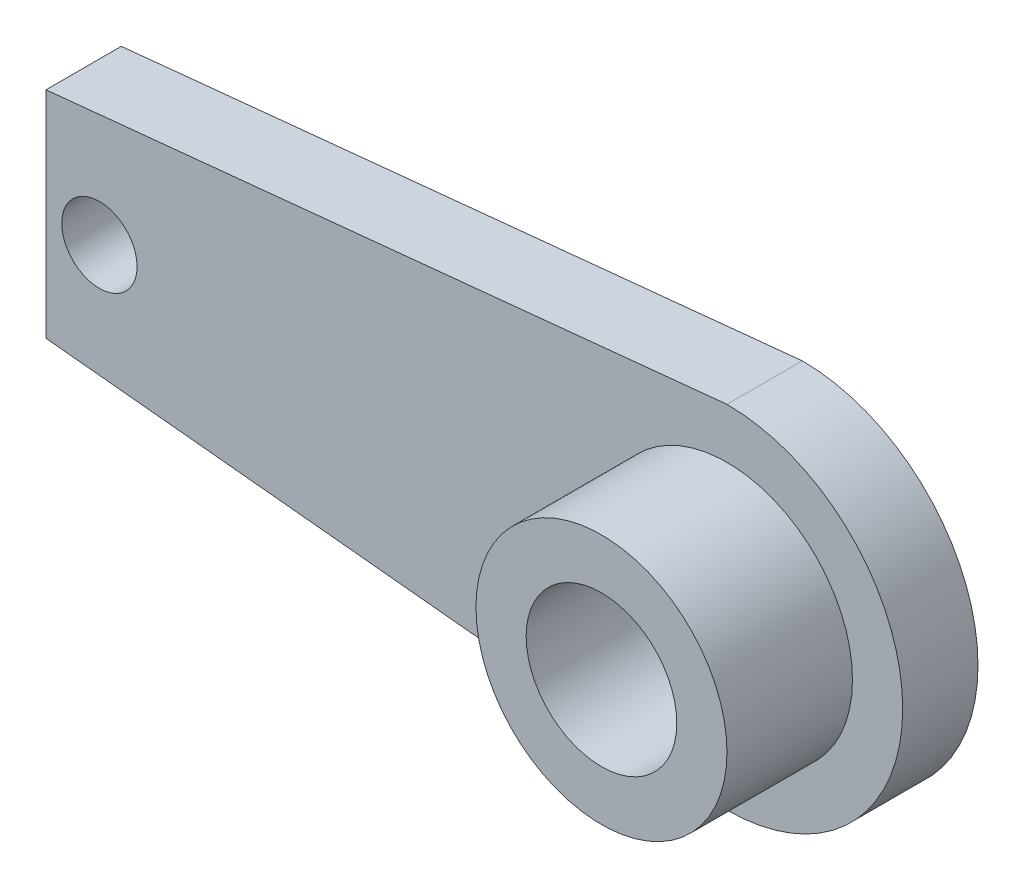
ISO-10303-21;
HEADER;
FILE_DESCRIPTION(('STEP AP214'),'2;1');
FILE_NAME('part.step','',(''),(''),'','','');
FILE_SCHEMA(('AUTOMOTIVE_DESIGN { 1 0 10303 214 1 1 1 1 }'));
ENDSEC;
DATA;
#1=APPLICATION_CONTEXT('core data for automotive mechanical design processes');
#2=APPLICATION_PROTOCOL_DEFINITION('international standard','automotive_design',2000,#1);
#3=PRODUCT_CONTEXT('',#1,'mechanical');
#4=PRODUCT('Part','Part','',(#3));
#5=PRODUCT_RELATED_PRODUCT_CATEGORY('part','',(#4));
#6=PRODUCT_DEFINITION_FORMATION('','',#4);
#7=PRODUCT_DEFINITION_CONTEXT('part definition',#1,'design');
#8=PRODUCT_DEFINITION('design','',#6,#7);
#9=PRODUCT_DEFINITION_SHAPE('','',#8);
#10=(LENGTH_UNIT() NAMED_UNIT(*) SI_UNIT(.MILLI.,.METRE.));
#11=(NAMED_UNIT(*) PLANE_ANGLE_UNIT() SI_UNIT($,.RADIAN.));
#12=(NAMED_UNIT(*) SI_UNIT($,.STERADIAN.) SOLID_ANGLE_UNIT());
#13=UNCERTAINTY_MEASURE_WITH_UNIT(LENGTH_MEASURE(1.E-05),#10,'distance_accuracy_value','');
#14=(GEOMETRIC_REPRESENTATION_CONTEXT(3) GLOBAL_UNCERTAINTY_ASSIGNED_CONTEXT((#13)) GLOBAL_UNIT_ASSIGNED_CONTEXT((#10,
#11,#12)) REPRESENTATION_CONTEXT('',''));
#15=CARTESIAN_POINT('',(0.,0.,0.));
#16=DIRECTION('',(0.,0.,1.));
#17=DIRECTION('',(1.,0.,0.));
#18=AXIS2_PLACEMENT_3D('',#15,#16,#17);
#19=CARTESIAN_POINT('',(-30.,-4.,-8.));
#20=DIRECTION('',(0.099503719020999,0.995037190209989,0.));
#21=DIRECTION('',(-0.995037190209989,0.099503719020999,0.));
#22=AXIS2_PLACEMENT_3D('',#19,#20,#21);
#23=PLANE('',#22);
#24=DIRECTION('',(0.,0.,1.));
#25=VECTOR('',#24,1.);
#26=CARTESIAN_POINT('',(-27.1280270584127,-4.28719729415873,-15.));
#27=LINE('',#26,#25);
#28=CARTESIAN_POINT('',(-27.1280270584127,-4.28719729415873,-8.));
#29=VERTEX_POINT('',#28);
#30=CARTESIAN_POINT('',(-27.1280270584127,-4.28719729415873,-5.));
#31=VERTEX_POINT('',#30);
#32=EDGE_CURVE('E146',#29,#31,#27,.T.);
#33=ORIENTED_EDGE('',*,*,#32,.F.);
#34=DIRECTION('',(0.995037190209989,-0.0995037190209989,0.));
#35=VECTOR('',#34,1.);
#36=CARTESIAN_POINT('',(-30.,-4.,-8.));
#37=LINE('',#36,#35);
#38=CARTESIAN_POINT('',(0.,-7.,-8.));
#39=VERTEX_POINT('',#38);
#40=EDGE_CURVE('E90',#29,#39,#37,.T.);
#41=ORIENTED_EDGE('',*,*,#40,.T.);
#42=DIRECTION('',(0.,0.,1.));
#43=VECTOR('',#42,1.);
#44=CARTESIAN_POINT('',(0.,-7.,-8.));
#45=LINE('',#44,#43);
#46=CARTESIAN_POINT('',(0.,-7.,-5.));
#47=VERTEX_POINT('',#46);
#48=EDGE_CURVE('E85',#39,#47,#45,.T.);
#49=ORIENTED_EDGE('',*,*,#48,.T.);
#50=DIRECTION('',(0.995037190209989,-0.0995037190209989,0.));
#51=VECTOR('',#50,1.);
#52=CARTESIAN_POINT('',(-30.,-4.,-5.));
#53=LINE('',#52,#51);
#54=EDGE_CURVE('E77',#31,#47,#53,.T.);
#55=ORIENTED_EDGE('',*,*,#54,.F.);
#56=EDGE_LOOP('',(#33,#41,#49,#55));
#57=FACE_BOUND('',#56,.T.);
#58=ADVANCED_FACE('F35',(#57),#23,.F.);
#59=CARTESIAN_POINT('',(-30.,4.,-8.));
#60=DIRECTION('',(0.099503719020999,-0.995037190209989,0.));
#61=DIRECTION('',(0.995037190209989,0.099503719020999,0.));
#62=AXIS2_PLACEMENT_3D('',#59,#60,#61);
#63=PLANE('',#62);
#64=DIRECTION('',(0.,0.,1.));
#65=VECTOR('',#64,1.);
#66=CARTESIAN_POINT('',(-27.1280270584127,4.28719729415873,-15.));
#67=LINE('',#66,#65);
#68=CARTESIAN_POINT('',(-27.1280270584127,4.28719729415873,-8.));
#69=VERTEX_POINT('',#68);
#70=CARTESIAN_POINT('',(-27.1280270584127,4.28719729415873,-5.));
#71=VERTEX_POINT('',#70);
#72=EDGE_CURVE('E89',#69,#71,#67,.T.);
#73=ORIENTED_EDGE('',*,*,#72,.T.);
#74=DIRECTION('',(-0.995037190209989,-0.0995037190209989,0.));
#75=VECTOR('',#74,1.);
#76=CARTESIAN_POINT('',(-30.,4.,-5.));
#77=LINE('',#76,#75);
#78=CARTESIAN_POINT('',(0.,7.,-5.));
#79=VERTEX_POINT('',#78);
#80=EDGE_CURVE('E74',#79,#71,#77,.T.);
#81=ORIENTED_EDGE('',*,*,#80,.F.);
#82=DIRECTION('',(0.,0.,1.));
#83=VECTOR('',#82,1.);
#84=CARTESIAN_POINT('',(0.,7.,-8.));
#85=LINE('',#84,#83);
#86=CARTESIAN_POINT('',(0.,7.,-8.));
#87=VERTEX_POINT('',#86);
#88=EDGE_CURVE('E81',#87,#79,#85,.T.);
#89=ORIENTED_EDGE('',*,*,#88,.F.);
#90=DIRECTION('',(-0.995037190209989,-0.0995037190209989,0.));
#91=VECTOR('',#90,1.);
#92=CARTESIAN_POINT('',(-30.,4.,-8.));
#93=LINE('',#92,#91);
#94=EDGE_CURVE('E86',#87,#69,#93,.T.);
#95=ORIENTED_EDGE('',*,*,#94,.T.);
#96=EDGE_LOOP('',(#73,#81,#89,#95));
#97=FACE_BOUND('',#96,.T.);
#98=ADVANCED_FACE('F88',(#97),#63,.F.);
#99=CARTESIAN_POINT('',(-30.,0.,-8.));
#100=DIRECTION('',(0.,0.,-1.));
#101=DIRECTION('',(1.,0.,0.));
#102=AXIS2_PLACEMENT_3D('',#99,#100,#101);
#103=PLANE('',#102);
#104=CARTESIAN_POINT('',(0.,0.,-8.));
#105=DIRECTION('',(0.,0.,-1.));
#106=DIRECTION('',(-1.,0.,0.));
#107=AXIS2_PLACEMENT_3D('',#104,#105,#106);
#108=CIRCLE('',#107,3.);
#109=CARTESIAN_POINT('',(-3.,0.,-8.));
#110=VERTEX_POINT('',#109);
#111=EDGE_CURVE('E148',#110,#110,#108,.T.);
#112=ORIENTED_EDGE('',*,*,#111,.F.);
#113=EDGE_LOOP('',(#112));
#114=FACE_BOUND('',#113,.T.);
#115=CARTESIAN_POINT('',(-25.,0.,-8.));
#116=DIRECTION('',(0.,0.,-1.));
#117=DIRECTION('',(-1.,0.,0.));
#118=AXIS2_PLACEMENT_3D('',#115,#116,#117);
#119=CIRCLE('',#118,1.5);
#120=CARTESIAN_POINT('',(-26.5,0.,-8.));
#121=VERTEX_POINT('',#120);
#122=EDGE_CURVE('E156',#121,#121,#119,.T.);
#123=ORIENTED_EDGE('',*,*,#122,.F.);
#124=EDGE_LOOP('',(#123));
#125=FACE_BOUND('',#124,.T.);
#126=ORIENTED_EDGE('',*,*,#94,.F.);
#127=CARTESIAN_POINT('',(0.,0.,-8.));
#128=DIRECTION('',(0.,0.,1.));
#129=DIRECTION('',(1.,0.,0.));
#130=AXIS2_PLACEMENT_3D('',#127,#128,#129);
#131=CIRCLE('',#130,7.);
#132=EDGE_CURVE('E59',#39,#87,#131,.T.);
#133=ORIENTED_EDGE('',*,*,#132,.F.);
#134=ORIENTED_EDGE('',*,*,#40,.F.);
#135=DIRECTION('',(0.,-1.,0.));
#136=VECTOR('',#135,1.);
#137=CARTESIAN_POINT('',(-27.1280270584127,0.,-8.));
#138=LINE('',#137,#136);
#139=EDGE_CURVE('E144',#69,#29,#138,.T.);
#140=ORIENTED_EDGE('',*,*,#139,.F.);
#141=EDGE_LOOP('',(#126,#133,#134,#140));
#142=FACE_BOUND('',#141,.T.);
#143=ADVANCED_FACE('F121',(#114,#125,#142),#103,.T.);
#144=CARTESIAN_POINT('',(-30.,0.,-5.));
#145=DIRECTION('',(0.,0.,-1.));
#146=DIRECTION('',(1.,0.,0.));
#147=AXIS2_PLACEMENT_3D('',#144,#145,#146);
#148=PLANE('',#147);
#149=CARTESIAN_POINT('',(0.,0.,-5.));
#150=DIRECTION('',(0.,0.,1.));
#151=DIRECTION('',(1.,0.,0.));
#152=AXIS2_PLACEMENT_3D('',#149,#150,#151);
#153=CIRCLE('',#152,5.);
#154=CARTESIAN_POINT('',(5.,0.,-5.));
#155=VERTEX_POINT('',#154);
#156=EDGE_CURVE('E11',#155,#155,#153,.T.);
#157=ORIENTED_EDGE('',*,*,#156,.F.);
#158=EDGE_LOOP('',(#157));
#159=FACE_BOUND('',#158,.T.);
#160=CARTESIAN_POINT('',(-25.,0.,-5.));
#161=DIRECTION('',(0.,0.,-1.));
#162=DIRECTION('',(-1.,0.,0.));
#163=AXIS2_PLACEMENT_3D('',#160,#161,#162);
#164=CIRCLE('',#163,1.5);
#165=CARTESIAN_POINT('',(-26.5,0.,-5.));
#166=VERTEX_POINT('',#165);
#167=EDGE_CURVE('E155',#166,#166,#164,.T.);
#168=ORIENTED_EDGE('',*,*,#167,.T.);
#169=EDGE_LOOP('',(#168));
#170=FACE_BOUND('',#169,.T.);
#171=DIRECTION('',(0.,1.,0.));
#172=VECTOR('',#171,1.);
#173=CARTESIAN_POINT('',(-27.1280270584127,0.,-5.));
#174=LINE('',#173,#172);
#175=EDGE_CURVE('E50',#31,#71,#174,.T.);
#176=ORIENTED_EDGE('',*,*,#175,.F.);
#177=ORIENTED_EDGE('',*,*,#54,.T.);
#178=CARTESIAN_POINT('',(0.,0.,-5.));
#179=DIRECTION('',(0.,0.,1.));
#180=DIRECTION('',(1.,0.,0.));
#181=AXIS2_PLACEMENT_3D('',#178,#179,#180);
#182=CIRCLE('',#181,7.);
#183=EDGE_CURVE('E71',#47,#79,#182,.T.);
#184=ORIENTED_EDGE('',*,*,#183,.T.);
#185=ORIENTED_EDGE('',*,*,#80,.T.);
#186=EDGE_LOOP('',(#176,#177,#184,#185));
#187=FACE_BOUND('',#186,.T.);
#188=ADVANCED_FACE('F72',(#159,#170,#187),#148,.F.);
#189=CARTESIAN_POINT('',(0.,0.,0.));
#190=DIRECTION('',(0.,0.,-1.));
#191=DIRECTION('',(1.,0.,0.));
#192=AXIS2_PLACEMENT_3D('',#189,#190,#191);
#193=PLANE('',#192);
#194=CARTESIAN_POINT('',(0.,0.,0.));
#195=DIRECTION('',(0.,0.,1.));
#196=DIRECTION('',(1.,0.,0.));
#197=AXIS2_PLACEMENT_3D('',#194,#195,#196);
#198=CIRCLE('',#197,5.);
#199=CARTESIAN_POINT('',(5.,0.,0.));
#200=VERTEX_POINT('',#199);
#201=EDGE_CURVE('E39',#200,#200,#198,.T.);
#202=ORIENTED_EDGE('',*,*,#201,.T.);
#203=EDGE_LOOP('',(#202));
#204=FACE_BOUND('',#203,.T.);
#205=CARTESIAN_POINT('',(0.,0.,0.));
#206=DIRECTION('',(0.,0.,1.));
#207=DIRECTION('',(1.,0.,0.));
#208=AXIS2_PLACEMENT_3D('',#205,#206,#207);
#209=CIRCLE('',#208,3.);
#210=CARTESIAN_POINT('',(3.,0.,0.));
#211=VERTEX_POINT('',#210);
#212=EDGE_CURVE('E97',#211,#211,#209,.T.);
#213=ORIENTED_EDGE('',*,*,#212,.F.);
#214=EDGE_LOOP('',(#213));
#215=FACE_BOUND('',#214,.T.);
#216=ADVANCED_FACE('F104',(#204,#215),#193,.F.);
#217=CARTESIAN_POINT('',(0.,0.,-5.));
#218=DIRECTION('',(0.,0.,1.));
#219=DIRECTION('',(-1.,0.,0.));
#220=AXIS2_PLACEMENT_3D('',#217,#218,#219);
#221=CYLINDRICAL_SURFACE('',#220,5.);
#222=ORIENTED_EDGE('',*,*,#156,.T.);
#223=EDGE_LOOP('',(#222));
#224=FACE_BOUND('',#223,.T.);
#225=ORIENTED_EDGE('',*,*,#201,.F.);
#226=EDGE_LOOP('',(#225));
#227=FACE_BOUND('',#226,.T.);
#228=ADVANCED_FACE('F37',(#224,#227),#221,.T.);
#229=CARTESIAN_POINT('',(0.,0.,-5.));
#230=DIRECTION('',(0.,0.,1.));
#231=DIRECTION('',(-1.,0.,0.));
#232=AXIS2_PLACEMENT_3D('',#229,#230,#231);
#233=CYLINDRICAL_SURFACE('',#232,3.);
#234=ORIENTED_EDGE('',*,*,#212,.T.);
#235=EDGE_LOOP('',(#234));
#236=FACE_BOUND('',#235,.T.);
#237=ORIENTED_EDGE('',*,*,#111,.T.);
#238=EDGE_LOOP('',(#237));
#239=FACE_BOUND('',#238,.T.);
#240=ADVANCED_FACE('F108',(#236,#239),#233,.F.);
#241=CARTESIAN_POINT('',(0.,0.,-8.));
#242=DIRECTION('',(0.,0.,1.));
#243=DIRECTION('',(-1.,0.,0.));
#244=AXIS2_PLACEMENT_3D('',#241,#242,#243);
#245=CYLINDRICAL_SURFACE('',#244,7.);
#246=ORIENTED_EDGE('',*,*,#183,.F.);
#247=ORIENTED_EDGE('',*,*,#48,.F.);
#248=ORIENTED_EDGE('',*,*,#132,.T.);
#249=ORIENTED_EDGE('',*,*,#88,.T.);
#250=EDGE_LOOP('',(#246,#247,#248,#249));
#251=FACE_BOUND('',#250,.T.);
#252=ADVANCED_FACE('F82',(#251),#245,.T.);
#253=CARTESIAN_POINT('',(-25.,0.,-8.));
#254=DIRECTION('',(0.,0.,1.));
#255=DIRECTION('',(-1.,0.,0.));
#256=AXIS2_PLACEMENT_3D('',#253,#254,#255);
#257=CYLINDRICAL_SURFACE('',#256,1.5);
#258=ORIENTED_EDGE('',*,*,#122,.T.);
#259=EDGE_LOOP('',(#258));
#260=FACE_BOUND('',#259,.T.);
#261=ORIENTED_EDGE('',*,*,#167,.F.);
#262=EDGE_LOOP('',(#261));
#263=FACE_BOUND('',#262,.T.);
#264=ADVANCED_FACE('F126',(#260,#263),#257,.F.);
#265=CARTESIAN_POINT('',(-27.1280270584127,0.,-15.));
#266=DIRECTION('',(-1.,0.,0.));
#267=DIRECTION('',(0.,0.,-1.));
#268=AXIS2_PLACEMENT_3D('',#265,#266,#267);
#269=PLANE('',#268);
#270=ORIENTED_EDGE('',*,*,#72,.F.);
#271=ORIENTED_EDGE('',*,*,#139,.T.);
#272=ORIENTED_EDGE('',*,*,#32,.T.);
#273=ORIENTED_EDGE('',*,*,#175,.T.);
#274=EDGE_LOOP('',(#270,#271,#272,#273));
#275=FACE_BOUND('',#274,.T.);
#276=ADVANCED_FACE('F136',(#275),#269,.T.);
#277=CLOSED_SHELL('',(#58,#98,#143,#188,#216,#228,#240,#252,#264,#276));
#278=MANIFOLD_SOLID_BREP('B2',#277);
#279=ADVANCED_BREP_SHAPE_REPRESENTATION('',(#18,#278),#14);
#280=SHAPE_DEFINITION_REPRESENTATION(#9,#279);
ENDSEC;
END-ISO-10303-21;
